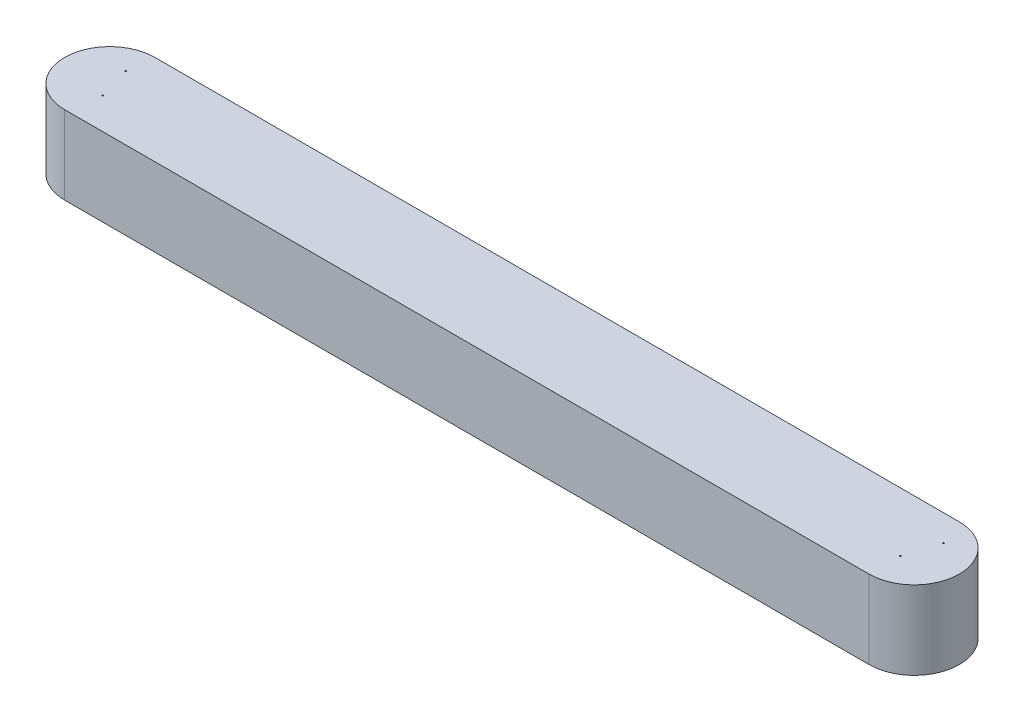
ISO-10303-21;
HEADER;
FILE_DESCRIPTION(('STEP AP214'),'2;1');
FILE_NAME('part.step','',(''),(''),'','','');
FILE_SCHEMA(('AUTOMOTIVE_DESIGN { 1 0 10303 214 1 1 1 1 }'));
ENDSEC;
DATA;
#1=APPLICATION_CONTEXT('core data for automotive mechanical design processes');
#2=APPLICATION_PROTOCOL_DEFINITION('international standard','automotive_design',2000,#1);
#3=PRODUCT_CONTEXT('',#1,'mechanical');
#4=PRODUCT('Part','Part','',(#3));
#5=PRODUCT_RELATED_PRODUCT_CATEGORY('part','',(#4));
#6=PRODUCT_DEFINITION_FORMATION('','',#4);
#7=PRODUCT_DEFINITION_CONTEXT('part definition',#1,'design');
#8=PRODUCT_DEFINITION('design','',#6,#7);
#9=PRODUCT_DEFINITION_SHAPE('','',#8);
#10=(LENGTH_UNIT() NAMED_UNIT(*) SI_UNIT(.MILLI.,.METRE.));
#11=(NAMED_UNIT(*) PLANE_ANGLE_UNIT() SI_UNIT($,.RADIAN.));
#12=(NAMED_UNIT(*) SI_UNIT($,.STERADIAN.) SOLID_ANGLE_UNIT());
#13=UNCERTAINTY_MEASURE_WITH_UNIT(LENGTH_MEASURE(1.E-05),#10,'distance_accuracy_value','');
#14=(GEOMETRIC_REPRESENTATION_CONTEXT(3) GLOBAL_UNCERTAINTY_ASSIGNED_CONTEXT((#13)) GLOBAL_UNIT_ASSIGNED_CONTEXT((#10,
#11,#12)) REPRESENTATION_CONTEXT('',''));
#15=CARTESIAN_POINT('',(0.,0.,0.));
#16=DIRECTION('',(0.,0.,1.));
#17=DIRECTION('',(1.,0.,0.));
#18=AXIS2_PLACEMENT_3D('',#15,#16,#17);
#19=CARTESIAN_POINT('',(0.,74.3410911877731,0.));
#20=DIRECTION('',(0.,-1.,0.));
#21=DIRECTION('',(0.,0.,-1.));
#22=AXIS2_PLACEMENT_3D('',#19,#20,#21);
#23=CYLINDRICAL_SURFACE('',#22,42.8540045116989);
#24=CARTESIAN_POINT('',(0.,0.,0.));
#25=DIRECTION('',(0.,1.,0.));
#26=DIRECTION('',(0.,0.,1.));
#27=AXIS2_PLACEMENT_3D('',#24,#25,#26);
#28=CIRCLE('',#27,42.8540045116989);
#29=CARTESIAN_POINT('',(0.,0.,42.8540045116989));
#30=VERTEX_POINT('',#29);
#31=CARTESIAN_POINT('',(0.,0.,-42.8540045116989));
#32=VERTEX_POINT('',#31);
#33=EDGE_CURVE('E113',#30,#32,#28,.T.);
#34=ORIENTED_EDGE('',*,*,#33,.T.);
#35=DIRECTION('',(0.,-1.,0.));
#36=VECTOR('',#35,1.);
#37=CARTESIAN_POINT('',(0.,74.3410911877731,-42.8540045116989));
#38=LINE('',#37,#36);
#39=CARTESIAN_POINT('',(0.,74.3410911877731,-42.8540045116989));
#40=VERTEX_POINT('',#39);
#41=EDGE_CURVE('E11',#40,#32,#38,.T.);
#42=ORIENTED_EDGE('',*,*,#41,.F.);
#43=CARTESIAN_POINT('',(0.,74.3410911877731,0.));
#44=DIRECTION('',(0.,1.,0.));
#45=DIRECTION('',(0.,0.,1.));
#46=AXIS2_PLACEMENT_3D('',#43,#44,#45);
#47=CIRCLE('',#46,42.8540045116989);
#48=CARTESIAN_POINT('',(0.,74.3410911877731,42.8540045116989));
#49=VERTEX_POINT('',#48);
#50=EDGE_CURVE('E97',#49,#40,#47,.T.);
#51=ORIENTED_EDGE('',*,*,#50,.F.);
#52=DIRECTION('',(0.,-1.,0.));
#53=VECTOR('',#52,1.);
#54=CARTESIAN_POINT('',(0.,74.3410911877731,42.8540045116989));
#55=LINE('',#54,#53);
#56=EDGE_CURVE('E109',#49,#30,#55,.T.);
#57=ORIENTED_EDGE('',*,*,#56,.T.);
#58=EDGE_LOOP('',(#34,#42,#51,#57));
#59=FACE_BOUND('',#58,.T.);
#60=ADVANCED_FACE('F45',(#59),#23,.T.);
#61=CARTESIAN_POINT('',(0.,74.3410911877731,-42.8540045116989));
#62=DIRECTION('',(0.,0.,1.));
#63=DIRECTION('',(1.,0.,0.));
#64=AXIS2_PLACEMENT_3D('',#61,#62,#63);
#65=PLANE('',#64);
#66=DIRECTION('',(-1.,0.,0.));
#67=VECTOR('',#66,1.);
#68=CARTESIAN_POINT('',(0.,0.,-42.8540045116989));
#69=LINE('',#68,#67);
#70=CARTESIAN_POINT('',(-763.0290048,0.,-42.8540045116989));
#71=VERTEX_POINT('',#70);
#72=EDGE_CURVE('E102',#32,#71,#69,.T.);
#73=ORIENTED_EDGE('',*,*,#72,.T.);
#74=DIRECTION('',(0.,-1.,0.));
#75=VECTOR('',#74,1.);
#76=CARTESIAN_POINT('',(-763.0290048,74.3410911877731,-42.8540045116989));
#77=LINE('',#76,#75);
#78=CARTESIAN_POINT('',(-763.0290048,74.3410911877731,-42.8540045116989));
#79=VERTEX_POINT('',#78);
#80=EDGE_CURVE('E54',#79,#71,#77,.T.);
#81=ORIENTED_EDGE('',*,*,#80,.F.);
#82=DIRECTION('',(-1.,0.,0.));
#83=VECTOR('',#82,1.);
#84=CARTESIAN_POINT('',(0.,74.3410911877731,-42.8540045116989));
#85=LINE('',#84,#83);
#86=EDGE_CURVE('E92',#40,#79,#85,.T.);
#87=ORIENTED_EDGE('',*,*,#86,.F.);
#88=ORIENTED_EDGE('',*,*,#41,.T.);
#89=EDGE_LOOP('',(#73,#81,#87,#88));
#90=FACE_BOUND('',#89,.T.);
#91=ADVANCED_FACE('F101',(#90),#65,.F.);
#92=CARTESIAN_POINT('',(-763.0290048,74.3410911877731,0.));
#93=DIRECTION('',(0.,-1.,0.));
#94=DIRECTION('',(0.,0.,-1.));
#95=AXIS2_PLACEMENT_3D('',#92,#93,#94);
#96=CYLINDRICAL_SURFACE('',#95,42.8540045116989);
#97=CARTESIAN_POINT('',(-763.0290048,0.,0.));
#98=DIRECTION('',(0.,1.,0.));
#99=DIRECTION('',(0.,0.,1.));
#100=AXIS2_PLACEMENT_3D('',#97,#98,#99);
#101=CIRCLE('',#100,42.8540045116989);
#102=CARTESIAN_POINT('',(-763.0290048,0.,42.8540045116989));
#103=VERTEX_POINT('',#102);
#104=EDGE_CURVE('E79',#71,#103,#101,.T.);
#105=ORIENTED_EDGE('',*,*,#104,.T.);
#106=DIRECTION('',(0.,-1.,0.));
#107=VECTOR('',#106,1.);
#108=CARTESIAN_POINT('',(-763.0290048,74.3410911877731,42.8540045116989));
#109=LINE('',#108,#107);
#110=CARTESIAN_POINT('',(-763.0290048,74.3410911877731,42.8540045116989));
#111=VERTEX_POINT('',#110);
#112=EDGE_CURVE('E104',#111,#103,#109,.T.);
#113=ORIENTED_EDGE('',*,*,#112,.F.);
#114=CARTESIAN_POINT('',(-763.0290048,74.3410911877731,0.));
#115=DIRECTION('',(0.,1.,0.));
#116=DIRECTION('',(0.,0.,1.));
#117=AXIS2_PLACEMENT_3D('',#114,#115,#116);
#118=CIRCLE('',#117,42.8540045116989);
#119=EDGE_CURVE('E95',#79,#111,#118,.T.);
#120=ORIENTED_EDGE('',*,*,#119,.F.);
#121=ORIENTED_EDGE('',*,*,#80,.T.);
#122=EDGE_LOOP('',(#105,#113,#120,#121));
#123=FACE_BOUND('',#122,.T.);
#124=ADVANCED_FACE('F105',(#123),#96,.T.);
#125=CARTESIAN_POINT('',(0.,74.3410911877731,42.8540045116989));
#126=DIRECTION('',(0.,0.,-1.));
#127=DIRECTION('',(-1.,0.,0.));
#128=AXIS2_PLACEMENT_3D('',#125,#126,#127);
#129=PLANE('',#128);
#130=DIRECTION('',(1.,0.,0.));
#131=VECTOR('',#130,1.);
#132=CARTESIAN_POINT('',(0.,0.,42.8540045116989));
#133=LINE('',#132,#131);
#134=EDGE_CURVE('E85',#103,#30,#133,.T.);
#135=ORIENTED_EDGE('',*,*,#134,.T.);
#136=ORIENTED_EDGE('',*,*,#56,.F.);
#137=DIRECTION('',(1.,0.,0.));
#138=VECTOR('',#137,1.);
#139=CARTESIAN_POINT('',(0.,74.3410911877731,42.8540045116989));
#140=LINE('',#139,#138);
#141=EDGE_CURVE('E62',#111,#49,#140,.T.);
#142=ORIENTED_EDGE('',*,*,#141,.F.);
#143=ORIENTED_EDGE('',*,*,#112,.T.);
#144=EDGE_LOOP('',(#135,#136,#142,#143));
#145=FACE_BOUND('',#144,.T.);
#146=ADVANCED_FACE('F127',(#145),#129,.F.);
#147=CARTESIAN_POINT('',(0.,74.3410911877731,0.));
#148=DIRECTION('',(0.,1.,0.));
#149=DIRECTION('',(0.,0.,1.));
#150=AXIS2_PLACEMENT_3D('',#147,#148,#149);
#151=PLANE('',#150);
#152=CARTESIAN_POINT('',(9.86299162316606,74.3410911877731,-17.8798050938149));
#153=DIRECTION('',(0.,1.,0.));
#154=DIRECTION('',(0.,0.,1.));
#155=AXIS2_PLACEMENT_3D('',#152,#153,#154);
#156=CIRCLE('',#155,0.595629999999988);
#157=CARTESIAN_POINT('',(9.86299162316606,74.3410911877731,-17.2841750938149));
#158=VERTEX_POINT('',#157);
#159=EDGE_CURVE('E161',#158,#158,#156,.T.);
#160=ORIENTED_EDGE('',*,*,#159,.F.);
#161=EDGE_LOOP('',(#160));
#162=FACE_BOUND('',#161,.T.);
#163=CARTESIAN_POINT('',(0.,74.3410911877731,13.0738141346716));
#164=DIRECTION('',(0.,1.,0.));
#165=DIRECTION('',(0.,0.,1.));
#166=AXIS2_PLACEMENT_3D('',#163,#164,#165);
#167=CIRCLE('',#166,0.595629999999988);
#168=CARTESIAN_POINT('',(0.,74.3410911877731,13.6694441346716));
#169=VERTEX_POINT('',#168);
#170=EDGE_CURVE('E153',#169,#169,#167,.T.);
#171=ORIENTED_EDGE('',*,*,#170,.F.);
#172=EDGE_LOOP('',(#171));
#173=FACE_BOUND('',#172,.T.);
#174=CARTESIAN_POINT('',(-765.853466011933,74.3410911877731,-17.8798050938149));
#175=DIRECTION('',(0.,1.,0.));
#176=DIRECTION('',(0.,0.,1.));
#177=AXIS2_PLACEMENT_3D('',#174,#175,#176);
#178=CIRCLE('',#177,0.595629999999958);
#179=CARTESIAN_POINT('',(-765.853466011933,74.3410911877731,-17.2841750938149));
#180=VERTEX_POINT('',#179);
#181=EDGE_CURVE('E145',#180,#180,#178,.T.);
#182=ORIENTED_EDGE('',*,*,#181,.F.);
#183=EDGE_LOOP('',(#182));
#184=FACE_BOUND('',#183,.T.);
#185=CARTESIAN_POINT('',(-756.473581397241,74.3410911877731,13.0738141346716));
#186=DIRECTION('',(0.,1.,0.));
#187=DIRECTION('',(0.,0.,1.));
#188=AXIS2_PLACEMENT_3D('',#185,#186,#187);
#189=CIRCLE('',#188,0.595629999999958);
#190=CARTESIAN_POINT('',(-756.473581397241,74.3410911877731,13.6694441346715));
#191=VERTEX_POINT('',#190);
#192=EDGE_CURVE('E137',#191,#191,#189,.T.);
#193=ORIENTED_EDGE('',*,*,#192,.F.);
#194=EDGE_LOOP('',(#193));
#195=FACE_BOUND('',#194,.T.);
#196=ORIENTED_EDGE('',*,*,#50,.T.);
#197=ORIENTED_EDGE('',*,*,#86,.T.);
#198=ORIENTED_EDGE('',*,*,#119,.T.);
#199=ORIENTED_EDGE('',*,*,#141,.T.);
#200=EDGE_LOOP('',(#196,#197,#198,#199));
#201=FACE_BOUND('',#200,.T.);
#202=ADVANCED_FACE('F93',(#162,#173,#184,#195,#201),#151,.T.);
#203=CARTESIAN_POINT('',(0.,0.,0.));
#204=DIRECTION('',(0.,1.,0.));
#205=DIRECTION('',(0.,0.,1.));
#206=AXIS2_PLACEMENT_3D('',#203,#204,#205);
#207=PLANE('',#206);
#208=CARTESIAN_POINT('',(9.86299162316606,0.,-17.8798050938149));
#209=DIRECTION('',(0.,1.,0.));
#210=DIRECTION('',(0.,0.,1.));
#211=AXIS2_PLACEMENT_3D('',#208,#209,#210);
#212=CIRCLE('',#211,0.595629999999991);
#213=CARTESIAN_POINT('',(9.86299162316606,0.,-17.2841750938149));
#214=VERTEX_POINT('',#213);
#215=EDGE_CURVE('E157',#214,#214,#212,.T.);
#216=ORIENTED_EDGE('',*,*,#215,.T.);
#217=EDGE_LOOP('',(#216));
#218=FACE_BOUND('',#217,.T.);
#219=CARTESIAN_POINT('',(0.,0.,13.0738141346716));
#220=DIRECTION('',(0.,1.,0.));
#221=DIRECTION('',(0.,0.,1.));
#222=AXIS2_PLACEMENT_3D('',#219,#220,#221);
#223=CIRCLE('',#222,0.595629999999991);
#224=CARTESIAN_POINT('',(0.,0.,13.6694441346716));
#225=VERTEX_POINT('',#224);
#226=EDGE_CURVE('E149',#225,#225,#223,.T.);
#227=ORIENTED_EDGE('',*,*,#226,.T.);
#228=EDGE_LOOP('',(#227));
#229=FACE_BOUND('',#228,.T.);
#230=CARTESIAN_POINT('',(-765.853466011933,0.,-17.8798050938149));
#231=DIRECTION('',(0.,1.,0.));
#232=DIRECTION('',(0.,0.,1.));
#233=AXIS2_PLACEMENT_3D('',#230,#231,#232);
#234=CIRCLE('',#233,0.595629999999958);
#235=CARTESIAN_POINT('',(-765.853466011933,0.,-17.2841750938149));
#236=VERTEX_POINT('',#235);
#237=EDGE_CURVE('E141',#236,#236,#234,.T.);
#238=ORIENTED_EDGE('',*,*,#237,.T.);
#239=EDGE_LOOP('',(#238));
#240=FACE_BOUND('',#239,.T.);
#241=CARTESIAN_POINT('',(-756.473581397241,0.,13.0738141346716));
#242=DIRECTION('',(0.,1.,0.));
#243=DIRECTION('',(0.,0.,1.));
#244=AXIS2_PLACEMENT_3D('',#241,#242,#243);
#245=CIRCLE('',#244,0.595629999999958);
#246=CARTESIAN_POINT('',(-756.473581397241,0.,13.6694441346715));
#247=VERTEX_POINT('',#246);
#248=EDGE_CURVE('E117',#247,#247,#245,.T.);
#249=ORIENTED_EDGE('',*,*,#248,.T.);
#250=EDGE_LOOP('',(#249));
#251=FACE_BOUND('',#250,.T.);
#252=ORIENTED_EDGE('',*,*,#33,.F.);
#253=ORIENTED_EDGE('',*,*,#134,.F.);
#254=ORIENTED_EDGE('',*,*,#104,.F.);
#255=ORIENTED_EDGE('',*,*,#72,.F.);
#256=EDGE_LOOP('',(#252,#253,#254,#255));
#257=FACE_BOUND('',#256,.T.);
#258=ADVANCED_FACE('F130',(#218,#229,#240,#251,#257),#207,.F.);
#259=CARTESIAN_POINT('',(-756.473581397241,74.3410911877731,13.0738141346716));
#260=DIRECTION('',(0.,1.,0.));
#261=DIRECTION('',(0.,0.,1.));
#262=AXIS2_PLACEMENT_3D('',#259,#260,#261);
#263=CYLINDRICAL_SURFACE('',#262,0.595629999999958);
#264=ORIENTED_EDGE('',*,*,#248,.F.);
#265=EDGE_LOOP('',(#264));
#266=FACE_BOUND('',#265,.T.);
#267=ORIENTED_EDGE('',*,*,#192,.T.);
#268=EDGE_LOOP('',(#267));
#269=FACE_BOUND('',#268,.T.);
#270=ADVANCED_FACE('F177',(#266,#269),#263,.F.);
#271=CARTESIAN_POINT('',(-765.853466011933,74.3410911877731,-17.8798050938149));
#272=DIRECTION('',(0.,1.,0.));
#273=DIRECTION('',(0.,0.,1.));
#274=AXIS2_PLACEMENT_3D('',#271,#272,#273);
#275=CYLINDRICAL_SURFACE('',#274,0.595629999999958);
#276=ORIENTED_EDGE('',*,*,#237,.F.);
#277=EDGE_LOOP('',(#276));
#278=FACE_BOUND('',#277,.T.);
#279=ORIENTED_EDGE('',*,*,#181,.T.);
#280=EDGE_LOOP('',(#279));
#281=FACE_BOUND('',#280,.T.);
#282=ADVANCED_FACE('F179',(#278,#281),#275,.F.);
#283=CARTESIAN_POINT('',(0.,74.3410911877731,13.0738141346716));
#284=DIRECTION('',(0.,1.,0.));
#285=DIRECTION('',(0.,0.,1.));
#286=AXIS2_PLACEMENT_3D('',#283,#284,#285);
#287=CYLINDRICAL_SURFACE('',#286,0.595629999999989);
#288=ORIENTED_EDGE('',*,*,#226,.F.);
#289=EDGE_LOOP('',(#288));
#290=FACE_BOUND('',#289,.T.);
#291=ORIENTED_EDGE('',*,*,#170,.T.);
#292=EDGE_LOOP('',(#291));
#293=FACE_BOUND('',#292,.T.);
#294=ADVANCED_FACE('F186',(#290,#293),#287,.F.);
#295=CARTESIAN_POINT('',(9.86299162316606,74.3410911877731,-17.8798050938149));
#296=DIRECTION('',(0.,1.,0.));
#297=DIRECTION('',(0.,0.,1.));
#298=AXIS2_PLACEMENT_3D('',#295,#296,#297);
#299=CYLINDRICAL_SURFACE('',#298,0.595629999999989);
#300=ORIENTED_EDGE('',*,*,#215,.F.);
#301=EDGE_LOOP('',(#300));
#302=FACE_BOUND('',#301,.T.);
#303=ORIENTED_EDGE('',*,*,#159,.T.);
#304=EDGE_LOOP('',(#303));
#305=FACE_BOUND('',#304,.T.);
#306=ADVANCED_FACE('F166',(#302,#305),#299,.F.);
#307=CLOSED_SHELL('',(#60,#91,#124,#146,#202,#258,#270,#282,#294,#306));
#308=MANIFOLD_SOLID_BREP('B2',#307);
#309=ADVANCED_BREP_SHAPE_REPRESENTATION('',(#18,#308),#14);
#310=SHAPE_DEFINITION_REPRESENTATION(#9,#309);
ENDSEC;
END-ISO-10303-21;
